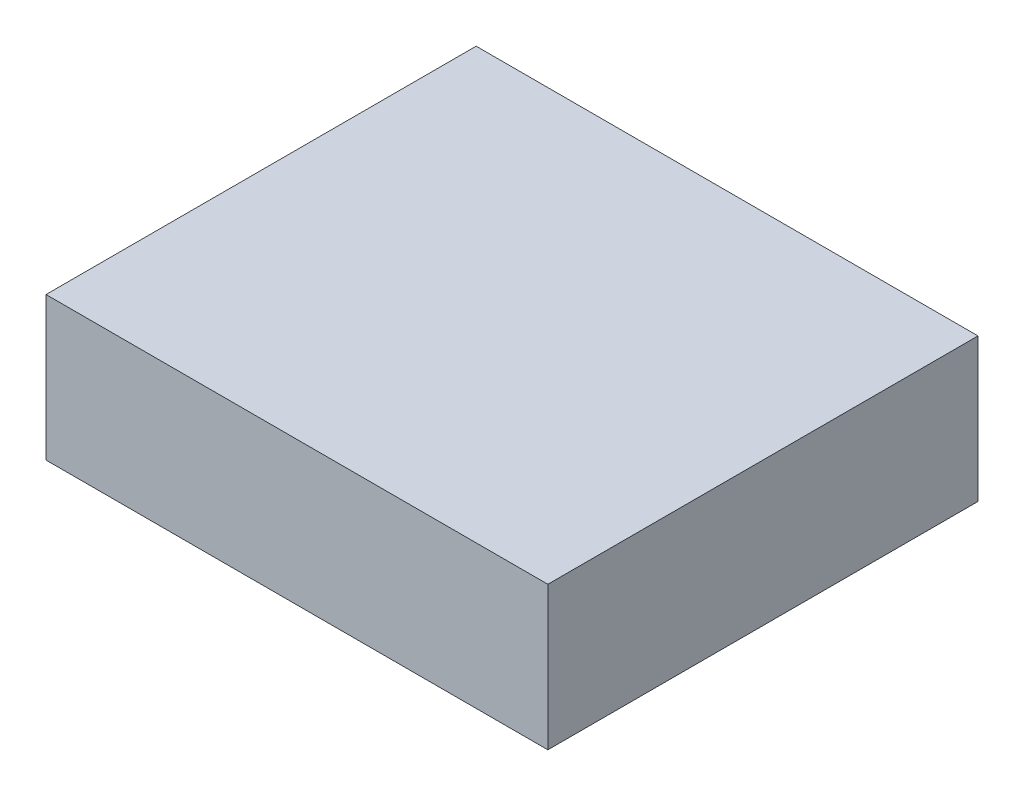
ISO-10303-21;
HEADER;
FILE_DESCRIPTION(('STEP AP214'),'2;1');
FILE_NAME('part.step','',(''),(''),'','','');
FILE_SCHEMA(('AUTOMOTIVE_DESIGN { 1 0 10303 214 1 1 1 1 }'));
ENDSEC;
DATA;
#1=APPLICATION_CONTEXT('core data for automotive mechanical design processes');
#2=APPLICATION_PROTOCOL_DEFINITION('international standard','automotive_design',2000,#1);
#3=PRODUCT_CONTEXT('',#1,'mechanical');
#4=PRODUCT('Part','Part','',(#3));
#5=PRODUCT_RELATED_PRODUCT_CATEGORY('part','',(#4));
#6=PRODUCT_DEFINITION_FORMATION('','',#4);
#7=PRODUCT_DEFINITION_CONTEXT('part definition',#1,'design');
#8=PRODUCT_DEFINITION('design','',#6,#7);
#9=PRODUCT_DEFINITION_SHAPE('','',#8);
#10=(LENGTH_UNIT() NAMED_UNIT(*) SI_UNIT(.MILLI.,.METRE.));
#11=(NAMED_UNIT(*) PLANE_ANGLE_UNIT() SI_UNIT($,.RADIAN.));
#12=(NAMED_UNIT(*) SI_UNIT($,.STERADIAN.) SOLID_ANGLE_UNIT());
#13=UNCERTAINTY_MEASURE_WITH_UNIT(LENGTH_MEASURE(1.E-05),#10,'distance_accuracy_value','');
#14=(GEOMETRIC_REPRESENTATION_CONTEXT(3) GLOBAL_UNCERTAINTY_ASSIGNED_CONTEXT((#13)) GLOBAL_UNIT_ASSIGNED_CONTEXT((#10,
#11,#12)) REPRESENTATION_CONTEXT('',''));
#15=CARTESIAN_POINT('',(0.,0.,0.));
#16=DIRECTION('',(0.,0.,1.));
#17=DIRECTION('',(1.,0.,0.));
#18=AXIS2_PLACEMENT_3D('',#15,#16,#17);
#19=CARTESIAN_POINT('',(177.8,101.6,-152.4));
#20=DIRECTION('',(-1.,0.,0.));
#21=DIRECTION('',(0.,0.,1.));
#22=AXIS2_PLACEMENT_3D('',#19,#20,#21);
#23=PLANE('',#22);
#24=DIRECTION('',(0.,0.,-1.));
#25=VECTOR('',#24,1.);
#26=CARTESIAN_POINT('',(177.8,0.,-152.4));
#27=LINE('',#26,#25);
#28=CARTESIAN_POINT('',(177.8,0.,152.4));
#29=VERTEX_POINT('',#28);
#30=CARTESIAN_POINT('',(177.8,0.,-152.4));
#31=VERTEX_POINT('',#30);
#32=EDGE_CURVE('E101',#29,#31,#27,.T.);
#33=ORIENTED_EDGE('',*,*,#32,.T.);
#34=DIRECTION('',(0.,-1.,0.));
#35=VECTOR('',#34,1.);
#36=CARTESIAN_POINT('',(177.8,101.6,-152.4));
#37=LINE('',#36,#35);
#38=CARTESIAN_POINT('',(177.8,101.6,-152.4));
#39=VERTEX_POINT('',#38);
#40=EDGE_CURVE('E11',#39,#31,#37,.T.);
#41=ORIENTED_EDGE('',*,*,#40,.F.);
#42=DIRECTION('',(0.,0.,-1.));
#43=VECTOR('',#42,1.);
#44=CARTESIAN_POINT('',(177.8,101.6,-152.4));
#45=LINE('',#44,#43);
#46=CARTESIAN_POINT('',(177.8,101.6,152.4));
#47=VERTEX_POINT('',#46);
#48=EDGE_CURVE('E89',#47,#39,#45,.T.);
#49=ORIENTED_EDGE('',*,*,#48,.F.);
#50=DIRECTION('',(0.,-1.,0.));
#51=VECTOR('',#50,1.);
#52=CARTESIAN_POINT('',(177.8,101.6,152.4));
#53=LINE('',#52,#51);
#54=EDGE_CURVE('E97',#47,#29,#53,.T.);
#55=ORIENTED_EDGE('',*,*,#54,.T.);
#56=EDGE_LOOP('',(#33,#41,#49,#55));
#57=FACE_BOUND('',#56,.T.);
#58=ADVANCED_FACE('F38',(#57),#23,.F.);
#59=CARTESIAN_POINT('',(-177.8,101.6,-152.4));
#60=DIRECTION('',(0.,0.,1.));
#61=DIRECTION('',(1.,0.,0.));
#62=AXIS2_PLACEMENT_3D('',#59,#60,#61);
#63=PLANE('',#62);
#64=DIRECTION('',(-1.,0.,0.));
#65=VECTOR('',#64,1.);
#66=CARTESIAN_POINT('',(-177.8,0.,-152.4));
#67=LINE('',#66,#65);
#68=CARTESIAN_POINT('',(-177.8,0.,-152.4));
#69=VERTEX_POINT('',#68);
#70=EDGE_CURVE('E93',#31,#69,#67,.T.);
#71=ORIENTED_EDGE('',*,*,#70,.T.);
#72=DIRECTION('',(0.,-1.,0.));
#73=VECTOR('',#72,1.);
#74=CARTESIAN_POINT('',(-177.8,101.6,-152.4));
#75=LINE('',#74,#73);
#76=CARTESIAN_POINT('',(-177.8,101.6,-152.4));
#77=VERTEX_POINT('',#76);
#78=EDGE_CURVE('E46',#77,#69,#75,.T.);
#79=ORIENTED_EDGE('',*,*,#78,.F.);
#80=DIRECTION('',(-1.,0.,0.));
#81=VECTOR('',#80,1.);
#82=CARTESIAN_POINT('',(-177.8,101.6,-152.4));
#83=LINE('',#82,#81);
#84=EDGE_CURVE('E84',#39,#77,#83,.T.);
#85=ORIENTED_EDGE('',*,*,#84,.F.);
#86=ORIENTED_EDGE('',*,*,#40,.T.);
#87=EDGE_LOOP('',(#71,#79,#85,#86));
#88=FACE_BOUND('',#87,.T.);
#89=ADVANCED_FACE('F92',(#88),#63,.F.);
#90=CARTESIAN_POINT('',(-177.8,101.6,-152.4));
#91=DIRECTION('',(1.,0.,0.));
#92=DIRECTION('',(0.,0.,-1.));
#93=AXIS2_PLACEMENT_3D('',#90,#91,#92);
#94=PLANE('',#93);
#95=DIRECTION('',(0.,0.,1.));
#96=VECTOR('',#95,1.);
#97=CARTESIAN_POINT('',(-177.8,0.,-152.4));
#98=LINE('',#97,#96);
#99=CARTESIAN_POINT('',(-177.8,0.,152.4));
#100=VERTEX_POINT('',#99);
#101=EDGE_CURVE('E71',#69,#100,#98,.T.);
#102=ORIENTED_EDGE('',*,*,#101,.T.);
#103=DIRECTION('',(0.,-1.,0.));
#104=VECTOR('',#103,1.);
#105=CARTESIAN_POINT('',(-177.8,101.6,152.4));
#106=LINE('',#105,#104);
#107=CARTESIAN_POINT('',(-177.8,101.6,152.4));
#108=VERTEX_POINT('',#107);
#109=EDGE_CURVE('E94',#108,#100,#106,.T.);
#110=ORIENTED_EDGE('',*,*,#109,.F.);
#111=DIRECTION('',(0.,0.,1.));
#112=VECTOR('',#111,1.);
#113=CARTESIAN_POINT('',(-177.8,101.6,-152.4));
#114=LINE('',#113,#112);
#115=EDGE_CURVE('E87',#77,#108,#114,.T.);
#116=ORIENTED_EDGE('',*,*,#115,.F.);
#117=ORIENTED_EDGE('',*,*,#78,.T.);
#118=EDGE_LOOP('',(#102,#110,#116,#117));
#119=FACE_BOUND('',#118,.T.);
#120=ADVANCED_FACE('F95',(#119),#94,.F.);
#121=CARTESIAN_POINT('',(-177.8,101.6,152.4));
#122=DIRECTION('',(0.,0.,-1.));
#123=DIRECTION('',(-1.,0.,0.));
#124=AXIS2_PLACEMENT_3D('',#121,#122,#123);
#125=PLANE('',#124);
#126=DIRECTION('',(1.,0.,0.));
#127=VECTOR('',#126,1.);
#128=CARTESIAN_POINT('',(-177.8,0.,152.4));
#129=LINE('',#128,#127);
#130=EDGE_CURVE('E77',#100,#29,#129,.T.);
#131=ORIENTED_EDGE('',*,*,#130,.T.);
#132=ORIENTED_EDGE('',*,*,#54,.F.);
#133=DIRECTION('',(1.,0.,0.));
#134=VECTOR('',#133,1.);
#135=CARTESIAN_POINT('',(-177.8,101.6,152.4));
#136=LINE('',#135,#134);
#137=EDGE_CURVE('E54',#108,#47,#136,.T.);
#138=ORIENTED_EDGE('',*,*,#137,.F.);
#139=ORIENTED_EDGE('',*,*,#109,.T.);
#140=EDGE_LOOP('',(#131,#132,#138,#139));
#141=FACE_BOUND('',#140,.T.);
#142=ADVANCED_FACE('F108',(#141),#125,.F.);
#143=CARTESIAN_POINT('',(0.,101.6,0.));
#144=DIRECTION('',(0.,1.,0.));
#145=DIRECTION('',(0.,0.,1.));
#146=AXIS2_PLACEMENT_3D('',#143,#144,#145);
#147=PLANE('',#146);
#148=ORIENTED_EDGE('',*,*,#48,.T.);
#149=ORIENTED_EDGE('',*,*,#84,.T.);
#150=ORIENTED_EDGE('',*,*,#115,.T.);
#151=ORIENTED_EDGE('',*,*,#137,.T.);
#152=EDGE_LOOP('',(#148,#149,#150,#151));
#153=FACE_BOUND('',#152,.T.);
#154=ADVANCED_FACE('F85',(#153),#147,.T.);
#155=CARTESIAN_POINT('',(0.,0.,0.));
#156=DIRECTION('',(0.,1.,0.));
#157=DIRECTION('',(0.,0.,1.));
#158=AXIS2_PLACEMENT_3D('',#155,#156,#157);
#159=PLANE('',#158);
#160=ORIENTED_EDGE('',*,*,#32,.F.);
#161=ORIENTED_EDGE('',*,*,#130,.F.);
#162=ORIENTED_EDGE('',*,*,#101,.F.);
#163=ORIENTED_EDGE('',*,*,#70,.F.);
#164=EDGE_LOOP('',(#160,#161,#162,#163));
#165=FACE_BOUND('',#164,.T.);
#166=ADVANCED_FACE('F111',(#165),#159,.F.);
#167=CLOSED_SHELL('',(#58,#89,#120,#142,#154,#166));
#168=MANIFOLD_SOLID_BREP('B2',#167);
#169=ADVANCED_BREP_SHAPE_REPRESENTATION('',(#18,#168),#14);
#170=SHAPE_DEFINITION_REPRESENTATION(#9,#169);
ENDSEC;
END-ISO-10303-21;
